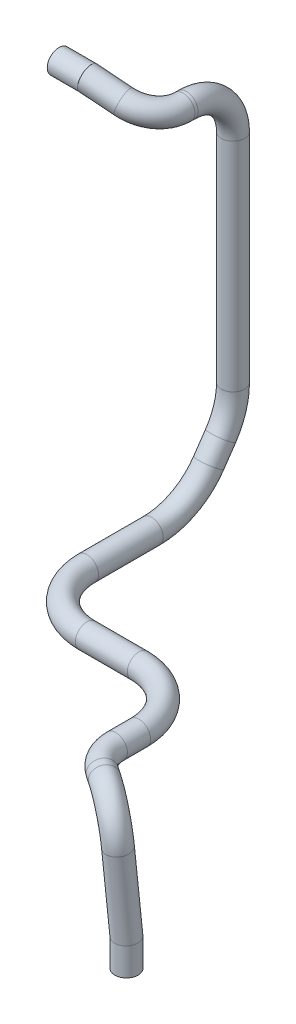
ISO-10303-21;
HEADER;
FILE_DESCRIPTION(('STEP AP214'),'2;1');
FILE_NAME('part.step','',(''),(''),'','','');
FILE_SCHEMA(('AUTOMOTIVE_DESIGN { 1 0 10303 214 1 1 1 1 }'));
ENDSEC;
DATA;
#1=APPLICATION_CONTEXT('core data for automotive mechanical design processes');
#2=APPLICATION_PROTOCOL_DEFINITION('international standard','automotive_design',2000,#1);
#3=PRODUCT_CONTEXT('',#1,'mechanical');
#4=PRODUCT('Part','Part','',(#3));
#5=PRODUCT_RELATED_PRODUCT_CATEGORY('part','',(#4));
#6=PRODUCT_DEFINITION_FORMATION('','',#4);
#7=PRODUCT_DEFINITION_CONTEXT('part definition',#1,'design');
#8=PRODUCT_DEFINITION('design','',#6,#7);
#9=PRODUCT_DEFINITION_SHAPE('','',#8);
#10=(LENGTH_UNIT() NAMED_UNIT(*) SI_UNIT(.MILLI.,.METRE.));
#11=(NAMED_UNIT(*) PLANE_ANGLE_UNIT() SI_UNIT($,.RADIAN.));
#12=(NAMED_UNIT(*) SI_UNIT($,.STERADIAN.) SOLID_ANGLE_UNIT());
#13=UNCERTAINTY_MEASURE_WITH_UNIT(LENGTH_MEASURE(1.E-05),#10,'distance_accuracy_value','');
#14=(GEOMETRIC_REPRESENTATION_CONTEXT(3) GLOBAL_UNCERTAINTY_ASSIGNED_CONTEXT((#13)) GLOBAL_UNIT_ASSIGNED_CONTEXT((#10,
#11,#12)) REPRESENTATION_CONTEXT('',''));
#15=CARTESIAN_POINT('',(0.,0.,0.));
#16=DIRECTION('',(0.,0.,1.));
#17=DIRECTION('',(1.,0.,0.));
#18=AXIS2_PLACEMENT_3D('',#15,#16,#17);
#19=CARTESIAN_POINT('',(1044.70999999994,559.076994308938,249.044106753027));
#20=DIRECTION('',(-1.,0.,0.));
#21=DIRECTION('',(0.,-0.720016310945798,-0.693957139866724));
#22=AXIS2_PLACEMENT_3D('',#19,#20,#21);
#23=PLANE('',#22);
#24=CARTESIAN_POINT('',(1044.70999999994,559.076994308938,249.044106753027));
#25=DIRECTION('',(-1.,0.,0.));
#26=DIRECTION('',(0.,-0.720016310945798,-0.693957139866724));
#27=AXIS2_PLACEMENT_3D('',#24,#25,#26);
#28=CIRCLE('',#27,7.50000000000006);
#29=CARTESIAN_POINT('',(1044.70999999994,553.676871976845,243.839428204027));
#30=VERTEX_POINT('',#29);
#31=EDGE_CURVE('E126',#30,#30,#28,.T.);
#32=ORIENTED_EDGE('',*,*,#31,.F.);
#33=EDGE_LOOP('',(#32));
#34=FACE_BOUND('',#33,.T.);
#35=CARTESIAN_POINT('',(1044.70999999994,559.076994308938,249.044106753027));
#36=DIRECTION('',(-1.,0.,0.));
#37=DIRECTION('',(0.,0.,1.));
#38=AXIS2_PLACEMENT_3D('',#35,#36,#37);
#39=CIRCLE('',#38,10.0000000000001);
#40=CARTESIAN_POINT('',(1044.70999999994,559.076994308938,259.044106753027));
#41=VERTEX_POINT('',#40);
#42=EDGE_CURVE('E59',#41,#41,#39,.T.);
#43=ORIENTED_EDGE('',*,*,#42,.T.);
#44=EDGE_LOOP('',(#43));
#45=FACE_BOUND('',#44,.T.);
#46=ADVANCED_FACE('F43',(#34,#45),#23,.T.);
#47=CARTESIAN_POINT('',(1308.29925162917,118.989999999999,454.620731707317));
#48=DIRECTION('',(0.,1.,0.));
#49=DIRECTION('',(0.,0.,1.));
#50=AXIS2_PLACEMENT_3D('',#47,#48,#49);
#51=PLANE('',#50);
#52=CARTESIAN_POINT('',(1308.29925162917,118.989999999999,454.620731707317));
#53=DIRECTION('',(0.,1.,0.));
#54=DIRECTION('',(0.,0.,1.));
#55=AXIS2_PLACEMENT_3D('',#52,#53,#54);
#56=CIRCLE('',#55,7.50000000000006);
#57=CARTESIAN_POINT('',(1308.29925162917,118.989999999999,462.120731707317));
#58=VERTEX_POINT('',#57);
#59=EDGE_CURVE('E68',#58,#58,#56,.T.);
#60=ORIENTED_EDGE('',*,*,#59,.T.);
#61=EDGE_LOOP('',(#60));
#62=FACE_BOUND('',#61,.T.);
#63=CARTESIAN_POINT('',(1308.29925162917,118.989999999999,454.620731707317));
#64=DIRECTION('',(0.,1.,0.));
#65=DIRECTION('',(0.,0.,1.));
#66=AXIS2_PLACEMENT_3D('',#63,#64,#65);
#67=CIRCLE('',#66,10.0000000000001);
#68=CARTESIAN_POINT('',(1308.29925162917,118.989999999999,464.620731707317));
#69=VERTEX_POINT('',#68);
#70=EDGE_CURVE('E47',#69,#69,#67,.T.);
#71=ORIENTED_EDGE('',*,*,#70,.F.);
#72=EDGE_LOOP('',(#71));
#73=FACE_BOUND('',#72,.T.);
#74=ADVANCED_FACE('F190',(#62,#73),#51,.F.);
#75=CARTESIAN_POINT('',(1071.91345155718,559.076994308938,249.044106753027));
#76=DIRECTION('',(-1.,0.,0.));
#77=DIRECTION('',(0.,0.,1.));
#78=AXIS2_PLACEMENT_3D('',#75,#76,#77);
#79=CYLINDRICAL_SURFACE('',#78,10.0000000000001);
#80=CARTESIAN_POINT('',(1069.70999999994,559.076994308938,249.044106753027));
#81=DIRECTION('',(-0.980493688608796,0.159330275576602,0.115091224178912));
#82=DIRECTION('',(0.196550570078838,0.794820027967867,0.574133256781771));
#83=AXIS2_PLACEMENT_3D('',#80,#81,#82);
#84=ELLIPSE('',#83,10.1989437730995,10.0000000000001);
#85=CARTESIAN_POINT('',(1071.71460821275,567.183319083916,254.899659557211));
#86=VERTEX_POINT('',#85);
#87=EDGE_CURVE('E61',#86,#86,#84,.F.);
#88=ORIENTED_EDGE('',*,*,#87,.F.);
#89=EDGE_LOOP('',(#88));
#90=FACE_BOUND('',#89,.T.);
#91=ORIENTED_EDGE('',*,*,#42,.F.);
#92=EDGE_LOOP('',(#91));
#93=FACE_BOUND('',#92,.T.);
#94=ADVANCED_FACE('F180',(#90,#93),#79,.T.);
#95=CARTESIAN_POINT('',(1308.31431511731,142.356133500652,454.568310126195));
#96=DIRECTION('',(-0.0236769556297378,0.996318305861415,0.0823968153361962));
#97=DIRECTION('',(0.,-0.0824199208056448,0.996597690472134));
#98=AXIS2_PLACEMENT_3D('',#95,#96,#97);
#99=CYLINDRICAL_SURFACE('',#98,10.0000000000001);
#100=CARTESIAN_POINT('',(1308.29925162917,142.989999999998,454.620731707317));
#101=DIRECTION('',(-0.0118493892955527,0.999079152485281,0.0412363800862165));
#102=DIRECTION('',(0.275922432081095,0.0429050937452933,-0.960221830831377));
#103=AXIS2_PLACEMENT_3D('',#100,#101,#102);
#104=ELLIPSE('',#103,10.0092169625643,10.0000000000001);
#105=CARTESIAN_POINT('',(1311.06101911671,143.419446392093,445.009663070335));
#106=VERTEX_POINT('',#105);
#107=EDGE_CURVE('E11',#106,#106,#104,.F.);
#108=ORIENTED_EDGE('',*,*,#107,.F.);
#109=EDGE_LOOP('',(#108));
#110=FACE_BOUND('',#109,.T.);
#111=CARTESIAN_POINT('',(1306.67607751975,211.292618972872,460.269446831165));
#112=DIRECTION('',(0.0236769556297413,-0.996318305861414,-0.0823968153362012));
#113=DIRECTION('',(0.,0.0824199208056498,-0.996597690472134));
#114=AXIS2_PLACEMENT_3D('',#111,#112,#113);
#115=CIRCLE('',#114,10.0000000000001);
#116=CARTESIAN_POINT('',(1314.98218813046,211.029996908545,465.831780529709));
#117=VERTEX_POINT('',#116);
#118=EDGE_CURVE('E57',#117,#117,#115,.F.);
#119=ORIENTED_EDGE('',*,*,#118,.F.);
#120=EDGE_LOOP('',(#119));
#121=FACE_BOUND('',#120,.T.);
#122=ADVANCED_FACE('F178',(#110,#121),#99,.T.);
#123=CARTESIAN_POINT('',(1281.75774568762,212.080485165852,443.582445735534));
#124=DIRECTION('',(-0.556349410890644,-0.081609619033109,0.826931196099715));
#125=DIRECTION('',(0.829698762662576,0.,0.558211396548109));
#126=AXIS2_PLACEMENT_3D('',#123,#124,#125);
#127=TOROIDAL_SURFACE('',#126,30.,10.0000000000001);
#128=CARTESIAN_POINT('',(1280.42380422821,241.980390487414,445.635799563911));
#129=DIRECTION('',(-0.829757929816715,0.00131014620710896,-0.55812190552172));
#130=DIRECTION('',(-0.558122384525742,0.,0.829758641950357));
#131=AXIS2_PLACEMENT_3D('',#128,#129,#130);
#132=CIRCLE('',#131,10.0000000000001);
#133=CARTESIAN_POINT('',(1279.97915707507,251.947025594601,446.320250840036));
#134=VERTEX_POINT('',#133);
#135=EDGE_CURVE('E169',#134,#134,#132,.T.);
#136=CARTESIAN_POINT('',(1281.75774568762,212.080485165852,443.582445735534));
#137=DIRECTION('',(-0.556349410890644,-0.081609619033109,0.826931196099715));
#138=DIRECTION('',(0.829698762662576,0.,0.558211396548109));
#139=AXIS2_PLACEMENT_3D('',#136,#137,#138);
#140=CIRCLE('',#139,40.0000000000001);
#141=EDGE_CURVE('',#117,#134,#140,.T.);
#142=ORIENTED_EDGE('',*,*,#118,.T.);
#143=ORIENTED_EDGE('',*,*,#135,.F.);
#144=ORIENTED_EDGE('',*,*,#141,.T.);
#145=ORIENTED_EDGE('',*,*,#141,.F.);
#146=EDGE_LOOP('',(#142,#144,#143,#145));
#147=FACE_BOUND('',#146,.T.);
#148=ADVANCED_FACE('F176',(#147),#127,.T.);
#149=CARTESIAN_POINT('',(1280.42380422821,241.980390487414,445.635799563911));
#150=DIRECTION('',(-0.829757929816715,0.00131014620710896,-0.55812190552172));
#151=DIRECTION('',(-0.558122384525742,0.,0.829758641950357));
#152=AXIS2_PLACEMENT_3D('',#149,#150,#151);
#153=CYLINDRICAL_SURFACE('',#152,10.0000000000001);
#154=CARTESIAN_POINT('',(1274.53045743773,241.989695786787,441.671744720436));
#155=DIRECTION('',(0.82975792981672,-0.00131014620711602,0.558121905521712));
#156=DIRECTION('',(0.558122384525733,0.,-0.829758641950362));
#157=AXIS2_PLACEMENT_3D('',#154,#155,#156);
#158=CIRCLE('',#157,10.0000000000001);
#159=CARTESIAN_POINT('',(1268.94924533972,241.998508241117,449.969334361873));
#160=VERTEX_POINT('',#159);
#161=EDGE_CURVE('E167',#160,#160,#158,.F.);
#162=ORIENTED_EDGE('',*,*,#161,.F.);
#163=EDGE_LOOP('',(#162));
#164=FACE_BOUND('',#163,.T.);
#165=ORIENTED_EDGE('',*,*,#135,.T.);
#166=EDGE_LOOP('',(#165));
#167=FACE_BOUND('',#166,.T.);
#168=ADVANCED_FACE('F187',(#164,#167),#153,.T.);
#169=CARTESIAN_POINT('',(1291.27409373176,241.963258423798,416.778975796125));
#170=DIRECTION('',(-0.00157894793998045,-0.999998753460924,0.));
#171=DIRECTION('',(0.999998753460924,-0.00157894793998045,0.));
#172=AXIS2_PLACEMENT_3D('',#169,#170,#171);
#173=TOROIDAL_SURFACE('',#172,30.,10.0000000000001);
#174=CARTESIAN_POINT('',(1261.27413112793,242.010626861997,416.778975796125));
#175=DIRECTION('',(0.,0.,-1.));
#176=DIRECTION('',(-1.,0.,0.));
#177=AXIS2_PLACEMENT_3D('',#174,#175,#176);
#178=CIRCLE('',#177,10.0000000000001);
#179=CARTESIAN_POINT('',(1251.27414359332,242.026416341397,416.778975796125));
#180=VERTEX_POINT('',#179);
#181=EDGE_CURVE('E164',#180,#180,#178,.T.);
#182=CARTESIAN_POINT('',(1291.27409373176,241.963258423798,416.778975796125));
#183=DIRECTION('',(-0.00157894793998045,-0.999998753460924,0.));
#184=DIRECTION('',(0.999998753460924,-0.00157894793998045,0.));
#185=AXIS2_PLACEMENT_3D('',#182,#183,#184);
#186=CIRCLE('',#185,40.0000000000001);
#187=EDGE_CURVE('',#160,#180,#186,.T.);
#188=ORIENTED_EDGE('',*,*,#161,.T.);
#189=ORIENTED_EDGE('',*,*,#181,.F.);
#190=ORIENTED_EDGE('',*,*,#187,.T.);
#191=ORIENTED_EDGE('',*,*,#187,.F.);
#192=EDGE_LOOP('',(#188,#190,#189,#191));
#193=FACE_BOUND('',#192,.T.);
#194=ADVANCED_FACE('F491',(#193),#173,.T.);
#195=CARTESIAN_POINT('',(1261.27413112793,242.010626861997,416.778975796125));
#196=DIRECTION('',(0.,0.,-1.));
#197=DIRECTION('',(-1.,0.,0.));
#198=AXIS2_PLACEMENT_3D('',#195,#196,#197);
#199=CYLINDRICAL_SURFACE('',#198,10.0000000000001);
#200=CARTESIAN_POINT('',(1261.27413112793,242.010626861993,396.867195516552));
#201=DIRECTION('',(0.,0.,1.));
#202=DIRECTION('',(1.,0.,0.));
#203=AXIS2_PLACEMENT_3D('',#200,#201,#202);
#204=CIRCLE('',#203,10.0000000000001);
#205=CARTESIAN_POINT('',(1271.27413112793,242.010626861993,396.867195516552));
#206=VERTEX_POINT('',#205);
#207=EDGE_CURVE('E161',#206,#206,#204,.F.);
#208=ORIENTED_EDGE('',*,*,#207,.F.);
#209=EDGE_LOOP('',(#208));
#210=FACE_BOUND('',#209,.T.);
#211=ORIENTED_EDGE('',*,*,#181,.T.);
#212=EDGE_LOOP('',(#211));
#213=FACE_BOUND('',#212,.T.);
#214=ADVANCED_FACE('F481',(#210,#213),#199,.T.);
#215=CARTESIAN_POINT('',(1211.27413112793,242.010626861993,396.867195516552));
#216=DIRECTION('',(0.,1.,0.));
#217=DIRECTION('',(0.,0.,1.));
#218=AXIS2_PLACEMENT_3D('',#215,#216,#217);
#219=TOROIDAL_SURFACE('',#218,50.,10.0000000000001);
#220=CARTESIAN_POINT('',(1211.27413112793,242.010626861993,346.867195516552));
#221=DIRECTION('',(-1.,0.,0.));
#222=DIRECTION('',(0.,-1.,0.));
#223=AXIS2_PLACEMENT_3D('',#220,#221,#222);
#224=CIRCLE('',#223,10.0000000000001);
#225=CARTESIAN_POINT('',(1211.27413112793,242.010626861993,336.867195516552));
#226=VERTEX_POINT('',#225);
#227=EDGE_CURVE('E158',#226,#226,#224,.T.);
#228=CARTESIAN_POINT('',(1211.27413112793,242.010626861993,396.867195516552));
#229=DIRECTION('',(0.,1.,0.));
#230=DIRECTION('',(0.,0.,1.));
#231=AXIS2_PLACEMENT_3D('',#228,#229,#230);
#232=CIRCLE('',#231,60.0000000000001);
#233=EDGE_CURVE('',#206,#226,#232,.T.);
#234=ORIENTED_EDGE('',*,*,#207,.T.);
#235=ORIENTED_EDGE('',*,*,#227,.F.);
#236=ORIENTED_EDGE('',*,*,#233,.T.);
#237=ORIENTED_EDGE('',*,*,#233,.F.);
#238=EDGE_LOOP('',(#234,#236,#235,#237));
#239=FACE_BOUND('',#238,.T.);
#240=ADVANCED_FACE('F471',(#239),#219,.T.);
#241=CARTESIAN_POINT('',(1211.27413112793,242.010626861993,346.867195516552));
#242=DIRECTION('',(-1.,0.,0.));
#243=DIRECTION('',(0.,-1.,0.));
#244=AXIS2_PLACEMENT_3D('',#241,#242,#243);
#245=CYLINDRICAL_SURFACE('',#244,10.0000000000001);
#246=CARTESIAN_POINT('',(1166.64506843882,242.01062686199,346.867195516552));
#247=DIRECTION('',(1.,0.,0.));
#248=DIRECTION('',(0.,0.,-1.));
#249=AXIS2_PLACEMENT_3D('',#246,#247,#248);
#250=CIRCLE('',#249,10.0000000000001);
#251=CARTESIAN_POINT('',(1166.64506843882,242.01062686199,356.867195516552));
#252=VERTEX_POINT('',#251);
#253=EDGE_CURVE('E155',#252,#252,#250,.F.);
#254=ORIENTED_EDGE('',*,*,#253,.F.);
#255=EDGE_LOOP('',(#254));
#256=FACE_BOUND('',#255,.T.);
#257=ORIENTED_EDGE('',*,*,#227,.T.);
#258=EDGE_LOOP('',(#257));
#259=FACE_BOUND('',#258,.T.);
#260=ADVANCED_FACE('F461',(#256,#259),#245,.T.);
#261=CARTESIAN_POINT('',(1166.64506843882,242.01062686199,296.867195516552));
#262=DIRECTION('',(0.,-1.,0.));
#263=DIRECTION('',(0.,0.,-1.));
#264=AXIS2_PLACEMENT_3D('',#261,#262,#263);
#265=TOROIDAL_SURFACE('',#264,50.,10.0000000000001);
#266=CARTESIAN_POINT('',(1116.64506843882,242.010626861987,296.867195516552));
#267=DIRECTION('',(0.,0.,-1.));
#268=DIRECTION('',(-1.,0.,0.));
#269=AXIS2_PLACEMENT_3D('',#266,#267,#268);
#270=CIRCLE('',#269,10.0000000000001);
#271=CARTESIAN_POINT('',(1106.64506843882,242.010626861986,296.867195516552));
#272=VERTEX_POINT('',#271);
#273=EDGE_CURVE('E152',#272,#272,#270,.T.);
#274=CARTESIAN_POINT('',(1166.64506843882,242.01062686199,296.867195516552));
#275=DIRECTION('',(0.,-1.,0.));
#276=DIRECTION('',(0.,0.,-1.));
#277=AXIS2_PLACEMENT_3D('',#274,#275,#276);
#278=CIRCLE('',#277,60.0000000000001);
#279=EDGE_CURVE('',#252,#272,#278,.T.);
#280=ORIENTED_EDGE('',*,*,#253,.T.);
#281=ORIENTED_EDGE('',*,*,#273,.F.);
#282=ORIENTED_EDGE('',*,*,#279,.T.);
#283=ORIENTED_EDGE('',*,*,#279,.F.);
#284=EDGE_LOOP('',(#280,#282,#281,#283));
#285=FACE_BOUND('',#284,.T.);
#286=ADVANCED_FACE('F451',(#285),#265,.T.);
#287=CARTESIAN_POINT('',(1116.64506843882,242.010626861987,296.867195516552));
#288=DIRECTION('',(0.,0.,-1.));
#289=DIRECTION('',(-1.,0.,0.));
#290=AXIS2_PLACEMENT_3D('',#287,#288,#289);
#291=CYLINDRICAL_SURFACE('',#290,10.0000000000001);
#292=CARTESIAN_POINT('',(1116.64506843882,242.010626861987,241.426485169388));
#293=DIRECTION('',(0.,0.,1.));
#294=DIRECTION('',(0.,-1.,0.));
#295=AXIS2_PLACEMENT_3D('',#292,#293,#294);
#296=CIRCLE('',#295,10.0000000000001);
#297=CARTESIAN_POINT('',(1116.7155678249,232.010875373247,241.426485169388));
#298=VERTEX_POINT('',#297);
#299=EDGE_CURVE('E149',#298,#298,#296,.F.);
#300=ORIENTED_EDGE('',*,*,#299,.F.);
#301=EDGE_LOOP('',(#300));
#302=FACE_BOUND('',#301,.T.);
#303=ORIENTED_EDGE('',*,*,#273,.T.);
#304=EDGE_LOOP('',(#303));
#305=FACE_BOUND('',#304,.T.);
#306=ADVANCED_FACE('F441',(#302,#305),#291,.T.);
#307=CARTESIAN_POINT('',(1116.22207212232,302.009135794428,241.426485169388));
#308=DIRECTION('',(0.999975148874021,0.00704993860825102,0.));
#309=DIRECTION('',(-0.00704993860825102,0.999975148874021,0.));
#310=AXIS2_PLACEMENT_3D('',#307,#308,#309);
#311=TOROIDAL_SURFACE('',#310,60.,10.0000000000001);
#312=CARTESIAN_POINT('',(1116.46323384617,267.802351294722,192.133100874803));
#313=DIRECTION('',(-0.00579192221781493,0.821535988308024,-0.570127243299056));
#314=DIRECTION('',(0.,0.570136806387386,0.821549768426961));
#315=AXIS2_PLACEMENT_3D('',#312,#313,#314);
#316=CIRCLE('',#315,10.0000000000001);
#317=CARTESIAN_POINT('',(1116.50342746681,262.10122054477,183.917536825706));
#318=VERTEX_POINT('',#317);
#319=EDGE_CURVE('E146',#318,#318,#316,.T.);
#320=CARTESIAN_POINT('',(1116.22207212232,302.009135794428,241.426485169388));
#321=DIRECTION('',(0.999975148874021,0.00704993860825102,0.));
#322=DIRECTION('',(-0.00704993860825102,0.999975148874021,0.));
#323=AXIS2_PLACEMENT_3D('',#320,#321,#322);
#324=CIRCLE('',#323,70.0000000000001);
#325=EDGE_CURVE('',#298,#318,#324,.T.);
#326=ORIENTED_EDGE('',*,*,#299,.T.);
#327=ORIENTED_EDGE('',*,*,#319,.F.);
#328=ORIENTED_EDGE('',*,*,#325,.T.);
#329=ORIENTED_EDGE('',*,*,#325,.F.);
#330=EDGE_LOOP('',(#326,#328,#327,#329));
#331=FACE_BOUND('',#330,.T.);
#332=ADVANCED_FACE('F431',(#331),#311,.T.);
#333=CARTESIAN_POINT('',(1116.46323384617,267.802351294722,192.133100874803));
#334=DIRECTION('',(-0.00579192221781493,0.821535988308024,-0.570127243299056));
#335=DIRECTION('',(0.,0.570136806387386,0.821549768426961));
#336=AXIS2_PLACEMENT_3D('',#333,#334,#335);
#337=CYLINDRICAL_SURFACE('',#336,10.0000000000001);
#338=CARTESIAN_POINT('',(1116.35842680711,282.668357981851,181.816431207228));
#339=DIRECTION('',(0.00579192221782893,-0.821535988308023,0.570127243299058));
#340=DIRECTION('',(0.,-0.570136806387387,-0.82154976842696));
#341=AXIS2_PLACEMENT_3D('',#338,#339,#340);
#342=CIRCLE('',#341,10.0000000000001);
#343=CARTESIAN_POINT('',(1116.27497127891,276.966791355785,173.601495225534));
#344=VERTEX_POINT('',#343);
#345=EDGE_CURVE('E143',#344,#344,#342,.F.);
#346=ORIENTED_EDGE('',*,*,#345,.F.);
#347=EDGE_LOOP('',(#346));
#348=FACE_BOUND('',#347,.T.);
#349=ORIENTED_EDGE('',*,*,#319,.T.);
#350=EDGE_LOOP('',(#349));
#351=FACE_BOUND('',#350,.T.);
#352=ADVANCED_FACE('F421',(#348,#351),#337,.T.);
#353=CARTESIAN_POINT('',(1116.8591599763,316.877757738251,231.106047097395));
#354=DIRECTION('',(0.999948401361366,0.,-0.0101584750257048));
#355=DIRECTION('',(-0.0101584750257048,0.,-0.999948401361366));
#356=AXIS2_PLACEMENT_3D('',#353,#354,#355);
#357=TOROIDAL_SURFACE('',#356,60.0000000000001,10.0000000000001);
#358=CARTESIAN_POINT('',(1116.24965147476,316.877757738251,171.109143015713));
#359=DIRECTION('',(0.,1.,0.));
#360=DIRECTION('',(0.,0.,1.));
#361=AXIS2_PLACEMENT_3D('',#358,#359,#360);
#362=CIRCLE('',#361,10.0000000000001);
#363=CARTESIAN_POINT('',(1116.1480667245,316.877757738251,161.109659002099));
#364=VERTEX_POINT('',#363);
#365=EDGE_CURVE('E140',#364,#364,#362,.T.);
#366=CARTESIAN_POINT('',(1116.8591599763,316.877757738251,231.106047097395));
#367=DIRECTION('',(0.999948401361366,0.,-0.0101584750257048));
#368=DIRECTION('',(-0.0101584750257048,0.,-0.999948401361366));
#369=AXIS2_PLACEMENT_3D('',#366,#367,#368);
#370=CIRCLE('',#369,70.0000000000001);
#371=EDGE_CURVE('',#344,#364,#370,.T.);
#372=ORIENTED_EDGE('',*,*,#345,.T.);
#373=ORIENTED_EDGE('',*,*,#365,.F.);
#374=ORIENTED_EDGE('',*,*,#371,.T.);
#375=ORIENTED_EDGE('',*,*,#371,.F.);
#376=EDGE_LOOP('',(#372,#374,#373,#375));
#377=FACE_BOUND('',#376,.T.);
#378=ADVANCED_FACE('F411',(#377),#357,.T.);
#379=CARTESIAN_POINT('',(1116.24965147476,316.877757738251,171.109143015713));
#380=DIRECTION('',(0.,1.,0.));
#381=DIRECTION('',(0.,0.,1.));
#382=AXIS2_PLACEMENT_3D('',#379,#380,#381);
#383=CYLINDRICAL_SURFACE('',#382,10.0000000000001);
#384=CARTESIAN_POINT('',(1116.24965147476,503.318348786234,171.109143015712));
#385=DIRECTION('',(0.,-1.,0.));
#386=DIRECTION('',(0.,0.,-1.));
#387=AXIS2_PLACEMENT_3D('',#384,#385,#386);
#388=CIRCLE('',#387,10.0000000000001);
#389=CARTESIAN_POINT('',(1116.24965147476,503.318348786234,161.109143015712));
#390=VERTEX_POINT('',#389);
#391=EDGE_CURVE('E137',#390,#390,#388,.F.);
#392=ORIENTED_EDGE('',*,*,#391,.F.);
#393=EDGE_LOOP('',(#392));
#394=FACE_BOUND('',#393,.T.);
#395=ORIENTED_EDGE('',*,*,#365,.T.);
#396=EDGE_LOOP('',(#395));
#397=FACE_BOUND('',#396,.T.);
#398=ADVANCED_FACE('F401',(#394,#397),#383,.T.);
#399=CARTESIAN_POINT('',(1116.24965147476,503.318348786234,211.109143015713));
#400=DIRECTION('',(1.,0.,0.));
#401=DIRECTION('',(0.,0.,-1.));
#402=AXIS2_PLACEMENT_3D('',#399,#400,#401);
#403=TOROIDAL_SURFACE('',#402,40.0000000000002,10.0000000000001);
#404=CARTESIAN_POINT('',(1116.24965147476,543.318348786234,211.109143015713));
#405=DIRECTION('',(0.,0.,1.));
#406=DIRECTION('',(1.,0.,0.));
#407=AXIS2_PLACEMENT_3D('',#404,#405,#406);
#408=CIRCLE('',#407,10.0000000000001);
#409=CARTESIAN_POINT('',(1116.24965147476,553.318348786234,211.109143015713));
#410=VERTEX_POINT('',#409);
#411=EDGE_CURVE('E134',#410,#410,#408,.T.);
#412=CARTESIAN_POINT('',(1116.24965147476,503.318348786234,211.109143015713));
#413=DIRECTION('',(1.,0.,0.));
#414=DIRECTION('',(0.,0.,-1.));
#415=AXIS2_PLACEMENT_3D('',#412,#413,#414);
#416=CIRCLE('',#415,50.0000000000003);
#417=EDGE_CURVE('',#390,#410,#416,.T.);
#418=ORIENTED_EDGE('',*,*,#391,.T.);
#419=ORIENTED_EDGE('',*,*,#411,.F.);
#420=ORIENTED_EDGE('',*,*,#417,.T.);
#421=ORIENTED_EDGE('',*,*,#417,.F.);
#422=EDGE_LOOP('',(#418,#420,#419,#421));
#423=FACE_BOUND('',#422,.T.);
#424=ADVANCED_FACE('F391',(#423),#403,.T.);
#425=CARTESIAN_POINT('',(1116.24965147476,543.318348786234,211.109143015713));
#426=DIRECTION('',(0.,0.,1.));
#427=DIRECTION('',(1.,0.,0.));
#428=AXIS2_PLACEMENT_3D('',#425,#426,#427);
#429=CYLINDRICAL_SURFACE('',#428,10.0000000000001);
#430=CARTESIAN_POINT('',(1116.24965147476,543.318348786234,213.816501265644));
#431=DIRECTION('',(0.,0.,-1.));
#432=DIRECTION('',(0.,1.,0.));
#433=AXIS2_PLACEMENT_3D('',#430,#431,#432);
#434=CIRCLE('',#433,10.0000000000001);
#435=CARTESIAN_POINT('',(1125.72139308197,540.111152046666,213.816501265644));
#436=VERTEX_POINT('',#435);
#437=EDGE_CURVE('E131',#436,#436,#434,.F.);
#438=ORIENTED_EDGE('',*,*,#437,.F.);
#439=EDGE_LOOP('',(#438));
#440=FACE_BOUND('',#439,.T.);
#441=ORIENTED_EDGE('',*,*,#411,.T.);
#442=EDGE_LOOP('',(#441));
#443=FACE_BOUND('',#442,.T.);
#444=ADVANCED_FACE('F381',(#440,#443),#429,.T.);
#445=CARTESIAN_POINT('',(1087.83442665314,552.939939004936,213.816501265644));
#446=DIRECTION('',(-0.320719673956741,-0.947174160720763,0.));
#447=DIRECTION('',(0.947174160720763,-0.320719673956741,0.));
#448=AXIS2_PLACEMENT_3D('',#445,#446,#447);
#449=TOROIDAL_SURFACE('',#448,30.,10.0000000000001);
#450=CARTESIAN_POINT('',(1094.247528015,550.768418852547,243.042459438992));
#451=DIRECTION('',(-0.922735746803369,0.312444659214317,0.225692437843357));
#452=DIRECTION('',(-0.32071967395674,-0.947174160720763,0.));
#453=AXIS2_PLACEMENT_3D('',#450,#451,#452);
#454=CIRCLE('',#453,10.0000000000001);
#455=CARTESIAN_POINT('',(1096.38522846895,550.044578801751,252.784445496774));
#456=VERTEX_POINT('',#455);
#457=EDGE_CURVE('E55',#456,#456,#454,.T.);
#458=CARTESIAN_POINT('',(1087.83442665314,552.939939004936,213.816501265644));
#459=DIRECTION('',(-0.320719673956741,-0.947174160720763,0.));
#460=DIRECTION('',(0.947174160720763,-0.320719673956741,0.));
#461=AXIS2_PLACEMENT_3D('',#458,#459,#460);
#462=CIRCLE('',#461,40.0000000000001);
#463=EDGE_CURVE('',#436,#456,#462,.T.);
#464=ORIENTED_EDGE('',*,*,#437,.T.);
#465=ORIENTED_EDGE('',*,*,#457,.F.);
#466=ORIENTED_EDGE('',*,*,#463,.T.);
#467=ORIENTED_EDGE('',*,*,#463,.F.);
#468=EDGE_LOOP('',(#464,#466,#465,#467));
#469=FACE_BOUND('',#468,.T.);
#470=ADVANCED_FACE('F204',(#469),#449,.T.);
#471=CARTESIAN_POINT('',(1094.247528015,550.768418852547,243.042459438992));
#472=DIRECTION('',(-0.922735746803369,0.312444659214317,0.225692437843357));
#473=DIRECTION('',(-0.32071967395674,-0.947174160720763,0.));
#474=AXIS2_PLACEMENT_3D('',#471,#472,#473);
#475=CYLINDRICAL_SURFACE('',#474,10.0000000000001);
#476=ORIENTED_EDGE('',*,*,#457,.T.);
#477=EDGE_LOOP('',(#476));
#478=FACE_BOUND('',#477,.T.);
#479=ORIENTED_EDGE('',*,*,#87,.T.);
#480=EDGE_LOOP('',(#479));
#481=FACE_BOUND('',#480,.T.);
#482=ADVANCED_FACE('F195',(#478,#481),#475,.T.);
#483=CARTESIAN_POINT('',(1308.29925162917,118.989999999999,454.620731707317));
#484=DIRECTION('',(0.,1.,0.));
#485=DIRECTION('',(0.,0.,1.));
#486=AXIS2_PLACEMENT_3D('',#483,#484,#485);
#487=CYLINDRICAL_SURFACE('',#486,10.0000000000001);
#488=ORIENTED_EDGE('',*,*,#70,.T.);
#489=EDGE_LOOP('',(#488));
#490=FACE_BOUND('',#489,.T.);
#491=ORIENTED_EDGE('',*,*,#107,.T.);
#492=EDGE_LOOP('',(#491));
#493=FACE_BOUND('',#492,.T.);
#494=ADVANCED_FACE('F45',(#490,#493),#487,.T.);
#495=CARTESIAN_POINT('',(1071.91345155718,559.076994308938,249.044106753027));
#496=DIRECTION('',(-1.,0.,0.));
#497=DIRECTION('',(0.,0.,1.));
#498=AXIS2_PLACEMENT_3D('',#495,#496,#497);
#499=CYLINDRICAL_SURFACE('',#498,7.50000000000006);
#500=CARTESIAN_POINT('',(1069.70999999994,559.076994308938,249.044106753027));
#501=DIRECTION('',(-0.980493688608796,0.159330275576602,0.115091224178912));
#502=DIRECTION('',(0.196550570078838,0.794820027967867,0.574133256781771));
#503=AXIS2_PLACEMENT_3D('',#500,#501,#502);
#504=ELLIPSE('',#503,7.64920782982465,7.50000000000006);
#505=CARTESIAN_POINT('',(1071.21345615955,565.156737890171,253.435771356165));
#506=VERTEX_POINT('',#505);
#507=EDGE_CURVE('E80',#506,#506,#504,.F.);
#508=ORIENTED_EDGE('',*,*,#507,.T.);
#509=EDGE_LOOP('',(#508));
#510=FACE_BOUND('',#509,.T.);
#511=ORIENTED_EDGE('',*,*,#31,.T.);
#512=EDGE_LOOP('',(#511));
#513=FACE_BOUND('',#512,.T.);
#514=ADVANCED_FACE('F194',(#510,#513),#499,.F.);
#515=CARTESIAN_POINT('',(1308.31431511731,142.356133500652,454.568310126195));
#516=DIRECTION('',(-0.0236769556297378,0.996318305861415,0.0823968153361962));
#517=DIRECTION('',(0.,-0.0824199208056448,0.996597690472134));
#518=AXIS2_PLACEMENT_3D('',#515,#516,#517);
#519=CYLINDRICAL_SURFACE('',#518,7.50000000000006);
#520=CARTESIAN_POINT('',(1308.29925162917,142.989999999999,454.620731707317));
#521=DIRECTION('',(-0.0118493892955527,0.999079152485281,0.0412363800862165));
#522=DIRECTION('',(0.275922432081095,0.0429050937452941,-0.960221830831377));
#523=AXIS2_PLACEMENT_3D('',#520,#521,#522);
#524=ELLIPSE('',#523,7.50691272192326,7.50000000000006);
#525=CARTESIAN_POINT('',(1310.37057724482,143.312084794071,447.412430229581));
#526=VERTEX_POINT('',#525);
#527=EDGE_CURVE('E62',#526,#526,#524,.F.);
#528=ORIENTED_EDGE('',*,*,#527,.T.);
#529=EDGE_LOOP('',(#528));
#530=FACE_BOUND('',#529,.T.);
#531=CARTESIAN_POINT('',(1306.67607751975,211.292618972872,460.269446831165));
#532=DIRECTION('',(-0.0236769556297378,0.996318305861415,0.0823968153361962));
#533=DIRECTION('',(0.000977251841561888,-0.0823968153361962,0.99659912191477));
#534=AXIS2_PLACEMENT_3D('',#531,#532,#533);
#535=CIRCLE('',#534,7.50000000000006);
#536=CARTESIAN_POINT('',(1312.90566047778,211.095652424627,464.441197105073));
#537=VERTEX_POINT('',#536);
#538=EDGE_CURVE('E76',#537,#537,#535,.T.);
#539=ORIENTED_EDGE('',*,*,#538,.T.);
#540=EDGE_LOOP('',(#539));
#541=FACE_BOUND('',#540,.T.);
#542=ADVANCED_FACE('F201',(#530,#541),#519,.F.);
#543=CARTESIAN_POINT('',(1281.75774568762,212.080485165852,443.582445735534));
#544=DIRECTION('',(-0.556349410890644,-0.081609619033109,0.826931196099715));
#545=DIRECTION('',(0.829698762662576,0.,0.558211396548109));
#546=AXIS2_PLACEMENT_3D('',#543,#544,#545);
#547=TOROIDAL_SURFACE('',#546,30.,7.50000000000006);
#548=CARTESIAN_POINT('',(1280.42380422821,241.980390487414,445.635799563911));
#549=DIRECTION('',(-0.829757929816714,0.00131014620711837,-0.558121905521721));
#550=DIRECTION('',(-0.486717640197498,0.487697410390388,0.724746282928783));
#551=AXIS2_PLACEMENT_3D('',#548,#549,#550);
#552=CIRCLE('',#551,7.50000000000006);
#553=CARTESIAN_POINT('',(1280.09031886336,249.455366817804,446.149138021005));
#554=VERTEX_POINT('',#553);
#555=EDGE_CURVE('E79',#554,#554,#552,.T.);
#556=CARTESIAN_POINT('',(1281.75774568762,212.080485165852,443.582445735534));
#557=DIRECTION('',(-0.556349410890644,-0.081609619033109,0.826931196099715));
#558=DIRECTION('',(0.829698762662576,0.,0.558211396548109));
#559=AXIS2_PLACEMENT_3D('',#556,#557,#558);
#560=CIRCLE('',#559,37.5000000000001);
#561=EDGE_CURVE('',#537,#554,#560,.T.);
#562=ORIENTED_EDGE('',*,*,#538,.F.);
#563=ORIENTED_EDGE('',*,*,#555,.T.);
#564=ORIENTED_EDGE('',*,*,#561,.T.);
#565=ORIENTED_EDGE('',*,*,#561,.F.);
#566=EDGE_LOOP('',(#562,#564,#563,#565));
#567=FACE_BOUND('',#566,.T.);
#568=ADVANCED_FACE('F277',(#567),#547,.F.);
#569=CARTESIAN_POINT('',(1280.42380422821,241.980390487414,445.635799563911));
#570=DIRECTION('',(-0.829757929816715,0.00131014620710896,-0.55812190552172));
#571=DIRECTION('',(-0.558122384525742,0.,0.829758641950357));
#572=AXIS2_PLACEMENT_3D('',#569,#570,#571);
#573=CYLINDRICAL_SURFACE('',#572,7.50000000000006);
#574=CARTESIAN_POINT('',(1274.53045743773,241.989695786788,441.671744720436));
#575=DIRECTION('',(-0.829757929816715,0.00131014620710897,-0.55812190552172));
#576=DIRECTION('',(-0.486717640197501,0.487697410390388,0.724746282928781));
#577=AXIS2_PLACEMENT_3D('',#574,#575,#576);
#578=CIRCLE('',#577,7.50000000000006);
#579=CARTESIAN_POINT('',(1270.34454836423,241.996305127535,447.894936951514));
#580=VERTEX_POINT('',#579);
#581=EDGE_CURVE('E83',#580,#580,#578,.T.);
#582=ORIENTED_EDGE('',*,*,#581,.T.);
#583=EDGE_LOOP('',(#582));
#584=FACE_BOUND('',#583,.T.);
#585=ORIENTED_EDGE('',*,*,#555,.F.);
#586=EDGE_LOOP('',(#585));
#587=FACE_BOUND('',#586,.T.);
#588=ADVANCED_FACE('F273',(#584,#587),#573,.F.);
#589=CARTESIAN_POINT('',(1291.27409373176,241.963258423798,416.778975796125));
#590=DIRECTION('',(-0.00157894793998045,-0.999998753460924,0.));
#591=DIRECTION('',(0.999998753460924,-0.00157894793998045,0.));
#592=AXIS2_PLACEMENT_3D('',#589,#590,#591);
#593=TOROIDAL_SURFACE('',#592,30.,7.50000000000006);
#594=CARTESIAN_POINT('',(1261.27413112793,242.010626861997,416.778975796125));
#595=DIRECTION('',(0.,0.,-1.));
#596=DIRECTION('',(-0.872672021067322,0.488306813024634,0.));
#597=AXIS2_PLACEMENT_3D('',#594,#595,#596);
#598=CIRCLE('',#597,7.50000000000006);
#599=CARTESIAN_POINT('',(1253.77414047698,242.022468971547,416.778975796125));
#600=VERTEX_POINT('',#599);
#601=EDGE_CURVE('E86',#600,#600,#598,.T.);
#602=CARTESIAN_POINT('',(1291.27409373176,241.963258423798,416.778975796125));
#603=DIRECTION('',(-0.00157894793998045,-0.999998753460924,0.));
#604=DIRECTION('',(0.999998753460924,-0.00157894793998045,0.));
#605=AXIS2_PLACEMENT_3D('',#602,#603,#604);
#606=CIRCLE('',#605,37.5000000000001);
#607=EDGE_CURVE('',#580,#600,#606,.T.);
#608=ORIENTED_EDGE('',*,*,#581,.F.);
#609=ORIENTED_EDGE('',*,*,#601,.T.);
#610=ORIENTED_EDGE('',*,*,#607,.T.);
#611=ORIENTED_EDGE('',*,*,#607,.F.);
#612=EDGE_LOOP('',(#608,#610,#609,#611));
#613=FACE_BOUND('',#612,.T.);
#614=ADVANCED_FACE('F269',(#613),#593,.F.);
#615=CARTESIAN_POINT('',(1261.27413112793,242.010626861997,416.778975796125));
#616=DIRECTION('',(0.,0.,-1.));
#617=DIRECTION('',(-1.,0.,0.));
#618=AXIS2_PLACEMENT_3D('',#615,#616,#617);
#619=CYLINDRICAL_SURFACE('',#618,7.50000000000006);
#620=CARTESIAN_POINT('',(1261.27413112793,242.010626861997,396.867195516552));
#621=DIRECTION('',(0.,0.,-1.));
#622=DIRECTION('',(-0.872672021067322,0.488306813024634,0.));
#623=AXIS2_PLACEMENT_3D('',#620,#621,#622);
#624=CIRCLE('',#623,7.50000000000006);
#625=CARTESIAN_POINT('',(1268.77413112793,242.010626861998,396.867195516552));
#626=VERTEX_POINT('',#625);
#627=EDGE_CURVE('E89',#626,#626,#624,.T.);
#628=ORIENTED_EDGE('',*,*,#627,.T.);
#629=EDGE_LOOP('',(#628));
#630=FACE_BOUND('',#629,.T.);
#631=ORIENTED_EDGE('',*,*,#601,.F.);
#632=EDGE_LOOP('',(#631));
#633=FACE_BOUND('',#632,.T.);
#634=ADVANCED_FACE('F265',(#630,#633),#619,.F.);
#635=CARTESIAN_POINT('',(1211.27413112793,242.010626861993,396.867195516552));
#636=DIRECTION('',(0.,1.,0.));
#637=DIRECTION('',(0.,0.,1.));
#638=AXIS2_PLACEMENT_3D('',#635,#636,#637);
#639=TOROIDAL_SURFACE('',#638,50.,7.50000000000006);
#640=CARTESIAN_POINT('',(1211.27413112793,242.010626861993,346.867195516552));
#641=DIRECTION('',(-1.,0.,0.));
#642=DIRECTION('',(0.,0.488306813024634,0.872672021067322));
#643=AXIS2_PLACEMENT_3D('',#640,#641,#642);
#644=CIRCLE('',#643,7.50000000000006);
#645=CARTESIAN_POINT('',(1211.27413112793,242.010626861993,339.367195516552));
#646=VERTEX_POINT('',#645);
#647=EDGE_CURVE('E92',#646,#646,#644,.T.);
#648=CARTESIAN_POINT('',(1211.27413112793,242.010626861993,396.867195516552));
#649=DIRECTION('',(0.,1.,0.));
#650=DIRECTION('',(0.,0.,1.));
#651=AXIS2_PLACEMENT_3D('',#648,#649,#650);
#652=CIRCLE('',#651,57.5000000000001);
#653=EDGE_CURVE('',#626,#646,#652,.T.);
#654=ORIENTED_EDGE('',*,*,#627,.F.);
#655=ORIENTED_EDGE('',*,*,#647,.T.);
#656=ORIENTED_EDGE('',*,*,#653,.T.);
#657=ORIENTED_EDGE('',*,*,#653,.F.);
#658=EDGE_LOOP('',(#654,#656,#655,#657));
#659=FACE_BOUND('',#658,.T.);
#660=ADVANCED_FACE('F261',(#659),#639,.F.);
#661=CARTESIAN_POINT('',(1211.27413112793,242.010626861993,346.867195516552));
#662=DIRECTION('',(-1.,0.,0.));
#663=DIRECTION('',(0.,-1.,0.));
#664=AXIS2_PLACEMENT_3D('',#661,#662,#663);
#665=CYLINDRICAL_SURFACE('',#664,7.50000000000006);
#666=CARTESIAN_POINT('',(1166.64506843882,242.01062686199,346.867195516552));
#667=DIRECTION('',(-1.,0.,0.));
#668=DIRECTION('',(0.,0.488306813024634,0.872672021067322));
#669=AXIS2_PLACEMENT_3D('',#666,#667,#668);
#670=CIRCLE('',#669,7.50000000000006);
#671=CARTESIAN_POINT('',(1166.64506843882,242.01062686199,354.367195516552));
#672=VERTEX_POINT('',#671);
#673=EDGE_CURVE('E95',#672,#672,#670,.T.);
#674=ORIENTED_EDGE('',*,*,#673,.T.);
#675=EDGE_LOOP('',(#674));
#676=FACE_BOUND('',#675,.T.);
#677=ORIENTED_EDGE('',*,*,#647,.F.);
#678=EDGE_LOOP('',(#677));
#679=FACE_BOUND('',#678,.T.);
#680=ADVANCED_FACE('F257',(#676,#679),#665,.F.);
#681=CARTESIAN_POINT('',(1166.64506843882,242.01062686199,296.867195516552));
#682=DIRECTION('',(0.,-1.,0.));
#683=DIRECTION('',(0.,0.,-1.));
#684=AXIS2_PLACEMENT_3D('',#681,#682,#683);
#685=TOROIDAL_SURFACE('',#684,50.,7.50000000000006);
#686=CARTESIAN_POINT('',(1116.64506843882,242.01062686199,296.867195516552));
#687=DIRECTION('',(0.,0.,-1.));
#688=DIRECTION('',(-0.872672021067322,0.488306813024634,0.));
#689=AXIS2_PLACEMENT_3D('',#686,#687,#688);
#690=CIRCLE('',#689,7.50000000000006);
#691=CARTESIAN_POINT('',(1109.14506843882,242.01062686199,296.867195516552));
#692=VERTEX_POINT('',#691);
#693=EDGE_CURVE('E98',#692,#692,#690,.T.);
#694=CARTESIAN_POINT('',(1166.64506843882,242.01062686199,296.867195516552));
#695=DIRECTION('',(0.,-1.,0.));
#696=DIRECTION('',(0.,0.,-1.));
#697=AXIS2_PLACEMENT_3D('',#694,#695,#696);
#698=CIRCLE('',#697,57.5);
#699=EDGE_CURVE('',#672,#692,#698,.T.);
#700=ORIENTED_EDGE('',*,*,#673,.F.);
#701=ORIENTED_EDGE('',*,*,#693,.T.);
#702=ORIENTED_EDGE('',*,*,#699,.T.);
#703=ORIENTED_EDGE('',*,*,#699,.F.);
#704=EDGE_LOOP('',(#700,#702,#701,#703));
#705=FACE_BOUND('',#704,.T.);
#706=ADVANCED_FACE('F253',(#705),#685,.F.);
#707=CARTESIAN_POINT('',(1116.64506843882,242.010626861987,296.867195516552));
#708=DIRECTION('',(0.,0.,-1.));
#709=DIRECTION('',(-1.,0.,0.));
#710=AXIS2_PLACEMENT_3D('',#707,#708,#709);
#711=CYLINDRICAL_SURFACE('',#710,7.50000000000006);
#712=CARTESIAN_POINT('',(1116.64506843882,242.010626861987,241.426485169388));
#713=DIRECTION('',(0.,0.,-1.));
#714=DIRECTION('',(-0.872672021067322,0.488306813024634,0.));
#715=AXIS2_PLACEMENT_3D('',#712,#713,#714);
#716=CIRCLE('',#715,7.50000000000006);
#717=CARTESIAN_POINT('',(1116.69794297838,234.510813245432,241.426485169388));
#718=VERTEX_POINT('',#717);
#719=EDGE_CURVE('E101',#718,#718,#716,.T.);
#720=ORIENTED_EDGE('',*,*,#719,.T.);
#721=EDGE_LOOP('',(#720));
#722=FACE_BOUND('',#721,.T.);
#723=ORIENTED_EDGE('',*,*,#693,.F.);
#724=EDGE_LOOP('',(#723));
#725=FACE_BOUND('',#724,.T.);
#726=ADVANCED_FACE('F249',(#722,#725),#711,.F.);
#727=CARTESIAN_POINT('',(1116.22207212232,302.009135794428,241.426485169388));
#728=DIRECTION('',(0.999975148874021,0.00704993860825102,0.));
#729=DIRECTION('',(-0.00704993860825102,0.999975148874021,0.));
#730=AXIS2_PLACEMENT_3D('',#727,#728,#729);
#731=TOROIDAL_SURFACE('',#730,60.,7.50000000000006);
#732=CARTESIAN_POINT('',(1116.46323384617,267.802351294722,192.133100874803));
#733=DIRECTION('',(-0.00579192221782908,0.821535988308025,-0.570127243299055));
#734=DIRECTION('',(-0.871173561701303,0.275762816419824,0.406216068703433));
#735=AXIS2_PLACEMENT_3D('',#732,#733,#734);
#736=CIRCLE('',#735,7.50000000000006);
#737=CARTESIAN_POINT('',(1116.49337906165,263.526503232258,185.97142783798));
#738=VERTEX_POINT('',#737);
#739=EDGE_CURVE('E104',#738,#738,#736,.T.);
#740=CARTESIAN_POINT('',(1116.22207212232,302.009135794428,241.426485169388));
#741=DIRECTION('',(0.999975148874021,0.00704993860825102,0.));
#742=DIRECTION('',(-0.00704993860825102,0.999975148874021,0.));
#743=AXIS2_PLACEMENT_3D('',#740,#741,#742);
#744=CIRCLE('',#743,67.5000000000001);
#745=EDGE_CURVE('',#718,#738,#744,.T.);
#746=ORIENTED_EDGE('',*,*,#719,.F.);
#747=ORIENTED_EDGE('',*,*,#739,.T.);
#748=ORIENTED_EDGE('',*,*,#745,.T.);
#749=ORIENTED_EDGE('',*,*,#745,.F.);
#750=EDGE_LOOP('',(#746,#748,#747,#749));
#751=FACE_BOUND('',#750,.T.);
#752=ADVANCED_FACE('F245',(#751),#731,.F.);
#753=CARTESIAN_POINT('',(1116.46323384617,267.802351294722,192.133100874803));
#754=DIRECTION('',(-0.00579192221781493,0.821535988308024,-0.570127243299056));
#755=DIRECTION('',(0.,0.570136806387386,0.821549768426961));
#756=AXIS2_PLACEMENT_3D('',#753,#754,#755);
#757=CYLINDRICAL_SURFACE('',#756,7.50000000000006);
#758=CARTESIAN_POINT('',(1116.35842680711,282.668357981851,181.816431207228));
#759=DIRECTION('',(-0.00579192221781491,0.821535988308024,-0.570127243299056));
#760=DIRECTION('',(-0.871173561701303,0.275762816419835,0.406216068703425));
#761=AXIS2_PLACEMENT_3D('',#758,#759,#760);
#762=CIRCLE('',#761,7.50000000000006);
#763=CARTESIAN_POINT('',(1116.29583516096,278.392183012302,175.655229220957));
#764=VERTEX_POINT('',#763);
#765=EDGE_CURVE('E107',#764,#764,#762,.T.);
#766=ORIENTED_EDGE('',*,*,#765,.T.);
#767=EDGE_LOOP('',(#766));
#768=FACE_BOUND('',#767,.T.);
#769=ORIENTED_EDGE('',*,*,#739,.F.);
#770=EDGE_LOOP('',(#769));
#771=FACE_BOUND('',#770,.T.);
#772=ADVANCED_FACE('F241',(#768,#771),#757,.F.);
#773=CARTESIAN_POINT('',(1116.8591599763,316.877757738251,231.106047097395));
#774=DIRECTION('',(0.999948401361366,0.,-0.0101584750257048));
#775=DIRECTION('',(-0.0101584750257048,0.,-0.999948401361366));
#776=AXIS2_PLACEMENT_3D('',#773,#774,#775);
#777=TOROIDAL_SURFACE('',#776,60.0000000000001,7.50000000000006);
#778=CARTESIAN_POINT('',(1116.24965147476,316.877757738251,171.109143015713));
#779=DIRECTION('',(0.,1.,0.));
#780=DIRECTION('',(-0.870296721060479,0.,0.4925277832888));
#781=AXIS2_PLACEMENT_3D('',#778,#779,#780);
#782=CIRCLE('',#781,7.50000000000006);
#783=CARTESIAN_POINT('',(1116.17346291207,316.877757738251,163.609530005502));
#784=VERTEX_POINT('',#783);
#785=EDGE_CURVE('E110',#784,#784,#782,.T.);
#786=CARTESIAN_POINT('',(1116.8591599763,316.877757738251,231.106047097395));
#787=DIRECTION('',(0.999948401361366,0.,-0.0101584750257048));
#788=DIRECTION('',(-0.0101584750257048,0.,-0.999948401361366));
#789=AXIS2_PLACEMENT_3D('',#786,#787,#788);
#790=CIRCLE('',#789,67.5000000000001);
#791=EDGE_CURVE('',#764,#784,#790,.T.);
#792=ORIENTED_EDGE('',*,*,#765,.F.);
#793=ORIENTED_EDGE('',*,*,#785,.T.);
#794=ORIENTED_EDGE('',*,*,#791,.T.);
#795=ORIENTED_EDGE('',*,*,#791,.F.);
#796=EDGE_LOOP('',(#792,#794,#793,#795));
#797=FACE_BOUND('',#796,.T.);
#798=ADVANCED_FACE('F237',(#797),#777,.F.);
#799=CARTESIAN_POINT('',(1116.24965147476,316.877757738251,171.109143015713));
#800=DIRECTION('',(0.,1.,0.));
#801=DIRECTION('',(0.,0.,1.));
#802=AXIS2_PLACEMENT_3D('',#799,#800,#801);
#803=CYLINDRICAL_SURFACE('',#802,7.50000000000006);
#804=CARTESIAN_POINT('',(1116.24965147476,503.318348786234,171.109143015713));
#805=DIRECTION('',(0.,1.,0.));
#806=DIRECTION('',(-0.870296721060479,0.,0.4925277832888));
#807=AXIS2_PLACEMENT_3D('',#804,#805,#806);
#808=CIRCLE('',#807,7.50000000000006);
#809=CARTESIAN_POINT('',(1116.24965147476,503.318348786234,163.609143015712));
#810=VERTEX_POINT('',#809);
#811=EDGE_CURVE('E113',#810,#810,#808,.T.);
#812=ORIENTED_EDGE('',*,*,#811,.T.);
#813=EDGE_LOOP('',(#812));
#814=FACE_BOUND('',#813,.T.);
#815=ORIENTED_EDGE('',*,*,#785,.F.);
#816=EDGE_LOOP('',(#815));
#817=FACE_BOUND('',#816,.T.);
#818=ADVANCED_FACE('F233',(#814,#817),#803,.F.);
#819=CARTESIAN_POINT('',(1116.24965147476,503.318348786234,211.109143015713));
#820=DIRECTION('',(1.,0.,0.));
#821=DIRECTION('',(0.,0.,-1.));
#822=AXIS2_PLACEMENT_3D('',#819,#820,#821);
#823=TOROIDAL_SURFACE('',#822,40.0000000000002,7.50000000000006);
#824=CARTESIAN_POINT('',(1116.24965147476,543.318348786234,211.109143015713));
#825=DIRECTION('',(0.,0.,1.));
#826=DIRECTION('',(-0.870296721060479,-0.4925277832888,0.));
#827=AXIS2_PLACEMENT_3D('',#824,#825,#826);
#828=CIRCLE('',#827,7.50000000000006);
#829=CARTESIAN_POINT('',(1116.24965147476,550.818348786234,211.109143015713));
#830=VERTEX_POINT('',#829);
#831=EDGE_CURVE('E116',#830,#830,#828,.T.);
#832=CARTESIAN_POINT('',(1116.24965147476,503.318348786234,211.109143015713));
#833=DIRECTION('',(1.,0.,0.));
#834=DIRECTION('',(0.,0.,-1.));
#835=AXIS2_PLACEMENT_3D('',#832,#833,#834);
#836=CIRCLE('',#835,47.5000000000003);
#837=EDGE_CURVE('',#810,#830,#836,.T.);
#838=ORIENTED_EDGE('',*,*,#811,.F.);
#839=ORIENTED_EDGE('',*,*,#831,.T.);
#840=ORIENTED_EDGE('',*,*,#837,.T.);
#841=ORIENTED_EDGE('',*,*,#837,.F.);
#842=EDGE_LOOP('',(#838,#840,#839,#841));
#843=FACE_BOUND('',#842,.T.);
#844=ADVANCED_FACE('F229',(#843),#823,.F.);
#845=CARTESIAN_POINT('',(1116.24965147476,543.318348786234,211.109143015713));
#846=DIRECTION('',(0.,0.,1.));
#847=DIRECTION('',(1.,0.,0.));
#848=AXIS2_PLACEMENT_3D('',#845,#846,#847);
#849=CYLINDRICAL_SURFACE('',#848,7.50000000000006);
#850=CARTESIAN_POINT('',(1116.24965147476,543.318348786234,213.816501265644));
#851=DIRECTION('',(0.,0.,1.));
#852=DIRECTION('',(-0.870296721060479,-0.4925277832888,0.));
#853=AXIS2_PLACEMENT_3D('',#850,#851,#852);
#854=CIRCLE('',#853,7.50000000000006);
#855=CARTESIAN_POINT('',(1123.35345768017,540.912951231558,213.816501265644));
#856=VERTEX_POINT('',#855);
#857=EDGE_CURVE('E119',#856,#856,#854,.T.);
#858=ORIENTED_EDGE('',*,*,#857,.T.);
#859=EDGE_LOOP('',(#858));
#860=FACE_BOUND('',#859,.T.);
#861=ORIENTED_EDGE('',*,*,#831,.F.);
#862=EDGE_LOOP('',(#861));
#863=FACE_BOUND('',#862,.T.);
#864=ADVANCED_FACE('F225',(#860,#863),#849,.F.);
#865=CARTESIAN_POINT('',(1087.83442665314,552.939939004936,213.816501265644));
#866=DIRECTION('',(-0.320719673956741,-0.947174160720763,0.));
#867=DIRECTION('',(0.947174160720763,-0.320719673956741,0.));
#868=AXIS2_PLACEMENT_3D('',#865,#866,#867);
#869=TOROIDAL_SURFACE('',#868,30.,7.50000000000006);
#870=CARTESIAN_POINT('',(1094.247528015,550.768418852547,243.042459438992));
#871=DIRECTION('',(-0.922735746803369,0.312444659214318,0.225692437843356));
#872=DIRECTION('',(-0.381586129557534,-0.658008544975499,-0.649166219445011));
#873=AXIS2_PLACEMENT_3D('',#870,#871,#872);
#874=CIRCLE('',#873,7.50000000000006);
#875=CARTESIAN_POINT('',(1095.85080335546,550.22553881445,250.348948982329));
#876=VERTEX_POINT('',#875);
#877=EDGE_CURVE('E73',#876,#876,#874,.T.);
#878=CARTESIAN_POINT('',(1087.83442665314,552.939939004936,213.816501265644));
#879=DIRECTION('',(-0.320719673956741,-0.947174160720763,0.));
#880=DIRECTION('',(0.947174160720763,-0.320719673956741,0.));
#881=AXIS2_PLACEMENT_3D('',#878,#879,#880);
#882=CIRCLE('',#881,37.5000000000001);
#883=EDGE_CURVE('',#856,#876,#882,.T.);
#884=ORIENTED_EDGE('',*,*,#857,.F.);
#885=ORIENTED_EDGE('',*,*,#877,.T.);
#886=ORIENTED_EDGE('',*,*,#883,.T.);
#887=ORIENTED_EDGE('',*,*,#883,.F.);
#888=EDGE_LOOP('',(#884,#886,#885,#887));
#889=FACE_BOUND('',#888,.T.);
#890=ADVANCED_FACE('F221',(#889),#869,.F.);
#891=CARTESIAN_POINT('',(1094.247528015,550.768418852547,243.042459438992));
#892=DIRECTION('',(-0.922735746803369,0.312444659214317,0.225692437843357));
#893=DIRECTION('',(-0.32071967395674,-0.947174160720763,0.));
#894=AXIS2_PLACEMENT_3D('',#891,#892,#893);
#895=CYLINDRICAL_SURFACE('',#894,7.50000000000006);
#896=ORIENTED_EDGE('',*,*,#877,.F.);
#897=EDGE_LOOP('',(#896));
#898=FACE_BOUND('',#897,.T.);
#899=ORIENTED_EDGE('',*,*,#507,.F.);
#900=EDGE_LOOP('',(#899));
#901=FACE_BOUND('',#900,.T.);
#902=ADVANCED_FACE('F218',(#898,#901),#895,.F.);
#903=CARTESIAN_POINT('',(1308.29925162917,118.989999999999,454.620731707317));
#904=DIRECTION('',(0.,1.,0.));
#905=DIRECTION('',(0.,0.,1.));
#906=AXIS2_PLACEMENT_3D('',#903,#904,#905);
#907=CYLINDRICAL_SURFACE('',#906,7.50000000000006);
#908=ORIENTED_EDGE('',*,*,#59,.F.);
#909=EDGE_LOOP('',(#908));
#910=FACE_BOUND('',#909,.T.);
#911=ORIENTED_EDGE('',*,*,#527,.F.);
#912=EDGE_LOOP('',(#911));
#913=FACE_BOUND('',#912,.T.);
#914=ADVANCED_FACE('F216',(#910,#913),#907,.F.);
#915=CLOSED_SHELL('',(#46,#74,#94,#122,#148,#168,#194,#214,#240,#260,#286,#306,#332,#352,#378,
#398,#424,#444,#470,#482,#494,#514,#542,#568,#588,#614,#634,#660,#680,#706,#726,#752,#772,#798,
#818,#844,#864,#890,#902,#914));
#916=MANIFOLD_SOLID_BREP('B2',#915);
#917=ADVANCED_BREP_SHAPE_REPRESENTATION('',(#18,#916),#14);
#918=SHAPE_DEFINITION_REPRESENTATION(#9,#917);
ENDSEC;
END-ISO-10303-21;
